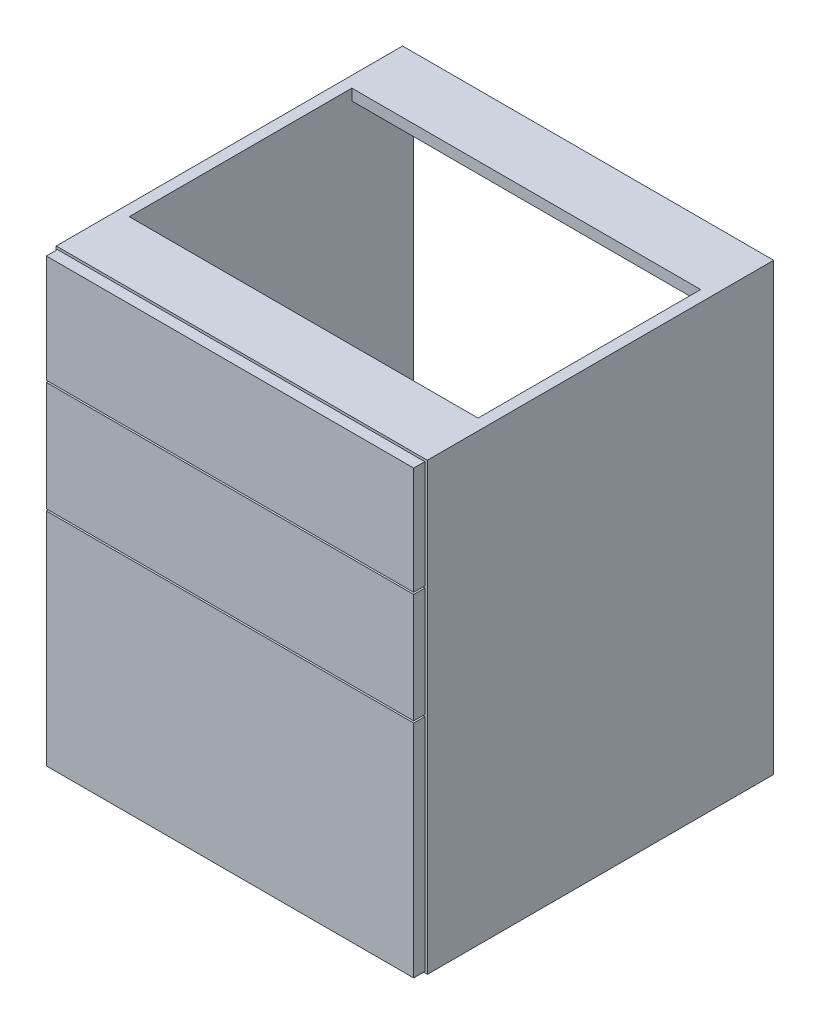
ISO-10303-21;
HEADER;
FILE_DESCRIPTION(('STEP AP214'),'2;1');
FILE_NAME('part.step','',(''),(''),'','','');
FILE_SCHEMA(('AUTOMOTIVE_DESIGN { 1 0 10303 214 1 1 1 1 }'));
ENDSEC;
DATA;
#1=APPLICATION_CONTEXT('core data for automotive mechanical design processes');
#2=APPLICATION_PROTOCOL_DEFINITION('international standard','automotive_design',2000,#1);
#3=PRODUCT_CONTEXT('',#1,'mechanical');
#4=PRODUCT('Part','Part','',(#3));
#5=PRODUCT_RELATED_PRODUCT_CATEGORY('part','',(#4));
#6=PRODUCT_DEFINITION_FORMATION('','',#4);
#7=PRODUCT_DEFINITION_CONTEXT('part definition',#1,'design');
#8=PRODUCT_DEFINITION('design','',#6,#7);
#9=PRODUCT_DEFINITION_SHAPE('','',#8);
#10=(LENGTH_UNIT() NAMED_UNIT(*) SI_UNIT(.MILLI.,.METRE.));
#11=(NAMED_UNIT(*) PLANE_ANGLE_UNIT() SI_UNIT($,.RADIAN.));
#12=(NAMED_UNIT(*) SI_UNIT($,.STERADIAN.) SOLID_ANGLE_UNIT());
#13=UNCERTAINTY_MEASURE_WITH_UNIT(LENGTH_MEASURE(1.E-05),#10,'distance_accuracy_value','');
#14=(GEOMETRIC_REPRESENTATION_CONTEXT(3) GLOBAL_UNCERTAINTY_ASSIGNED_CONTEXT((#13)) GLOBAL_UNIT_ASSIGNED_CONTEXT((#10,
#11,#12)) REPRESENTATION_CONTEXT('',''));
#15=CARTESIAN_POINT('',(0.,0.,0.));
#16=DIRECTION('',(0.,0.,1.));
#17=DIRECTION('',(1.,0.,0.));
#18=AXIS2_PLACEMENT_3D('',#15,#16,#17);
#19=CARTESIAN_POINT('',(0.,0.,1.));
#20=DIRECTION('',(0.,0.,1.));
#21=DIRECTION('',(1.,0.,0.));
#22=AXIS2_PLACEMENT_3D('',#19,#20,#21);
#23=PLANE('',#22);
#24=DIRECTION('',(0.,1.,0.));
#25=VECTOR('',#24,1.);
#26=CARTESIAN_POINT('',(597.,717.,1.));
#27=LINE('',#26,#25);
#28=CARTESIAN_POINT('',(597.,543.,1.));
#29=VERTEX_POINT('',#28);
#30=CARTESIAN_POINT('',(597.,717.,1.));
#31=VERTEX_POINT('',#30);
#32=EDGE_CURVE('E101',#29,#31,#27,.T.);
#33=ORIENTED_EDGE('',*,*,#32,.F.);
#34=DIRECTION('',(-1.,0.,0.));
#35=VECTOR('',#34,1.);
#36=CARTESIAN_POINT('',(3.00000000000002,543.,1.));
#37=LINE('',#36,#35);
#38=CARTESIAN_POINT('',(3.00000000000002,543.,1.));
#39=VERTEX_POINT('',#38);
#40=EDGE_CURVE('E95',#29,#39,#37,.T.);
#41=ORIENTED_EDGE('',*,*,#40,.T.);
#42=DIRECTION('',(0.,-1.,0.));
#43=VECTOR('',#42,1.);
#44=CARTESIAN_POINT('',(3.,717.,1.));
#45=LINE('',#44,#43);
#46=CARTESIAN_POINT('',(3.,717.,1.));
#47=VERTEX_POINT('',#46);
#48=EDGE_CURVE('E52',#47,#39,#45,.T.);
#49=ORIENTED_EDGE('',*,*,#48,.F.);
#50=DIRECTION('',(-1.,0.,0.));
#51=VECTOR('',#50,1.);
#52=CARTESIAN_POINT('',(3.,717.,1.));
#53=LINE('',#52,#51);
#54=EDGE_CURVE('E104',#31,#47,#53,.T.);
#55=ORIENTED_EDGE('',*,*,#54,.F.);
#56=EDGE_LOOP('',(#33,#41,#49,#55));
#57=FACE_BOUND('',#56,.T.);
#58=ADVANCED_FACE('F49',(#57),#23,.F.);
#59=CARTESIAN_POINT('',(0.,0.,19.));
#60=DIRECTION('',(0.,0.,1.));
#61=DIRECTION('',(1.,0.,0.));
#62=AXIS2_PLACEMENT_3D('',#59,#60,#61);
#63=PLANE('',#62);
#64=DIRECTION('',(-1.,0.,0.));
#65=VECTOR('',#64,1.);
#66=CARTESIAN_POINT('',(3.00000000000002,543.,19.));
#67=LINE('',#66,#65);
#68=CARTESIAN_POINT('',(597.,543.,19.));
#69=VERTEX_POINT('',#68);
#70=CARTESIAN_POINT('',(3.00000000000002,543.,19.));
#71=VERTEX_POINT('',#70);
#72=EDGE_CURVE('E58',#69,#71,#67,.T.);
#73=ORIENTED_EDGE('',*,*,#72,.F.);
#74=DIRECTION('',(0.,1.,0.));
#75=VECTOR('',#74,1.);
#76=CARTESIAN_POINT('',(597.,717.,19.));
#77=LINE('',#76,#75);
#78=CARTESIAN_POINT('',(597.,717.,19.));
#79=VERTEX_POINT('',#78);
#80=EDGE_CURVE('E91',#69,#79,#77,.T.);
#81=ORIENTED_EDGE('',*,*,#80,.T.);
#82=DIRECTION('',(-1.,0.,0.));
#83=VECTOR('',#82,1.);
#84=CARTESIAN_POINT('',(3.,717.,19.));
#85=LINE('',#84,#83);
#86=CARTESIAN_POINT('',(3.,717.,19.));
#87=VERTEX_POINT('',#86);
#88=EDGE_CURVE('E88',#79,#87,#85,.T.);
#89=ORIENTED_EDGE('',*,*,#88,.T.);
#90=DIRECTION('',(0.,-1.,0.));
#91=VECTOR('',#90,1.);
#92=CARTESIAN_POINT('',(3.,717.,19.));
#93=LINE('',#92,#91);
#94=EDGE_CURVE('E110',#87,#71,#93,.T.);
#95=ORIENTED_EDGE('',*,*,#94,.T.);
#96=EDGE_LOOP('',(#73,#81,#89,#95));
#97=FACE_BOUND('',#96,.T.);
#98=ADVANCED_FACE('F93',(#97),#63,.T.);
#99=CARTESIAN_POINT('',(597.,717.,19.));
#100=DIRECTION('',(-1.,0.,0.));
#101=DIRECTION('',(0.,0.,1.));
#102=AXIS2_PLACEMENT_3D('',#99,#100,#101);
#103=PLANE('',#102);
#104=ORIENTED_EDGE('',*,*,#80,.F.);
#105=DIRECTION('',(0.,0.,1.));
#106=VECTOR('',#105,1.);
#107=CARTESIAN_POINT('',(597.,543.,1.));
#108=LINE('',#107,#106);
#109=EDGE_CURVE('E12',#29,#69,#108,.T.);
#110=ORIENTED_EDGE('',*,*,#109,.F.);
#111=ORIENTED_EDGE('',*,*,#32,.T.);
#112=DIRECTION('',(0.,0.,-1.));
#113=VECTOR('',#112,1.);
#114=CARTESIAN_POINT('',(597.,717.,19.));
#115=LINE('',#114,#113);
#116=EDGE_CURVE('E98',#79,#31,#115,.T.);
#117=ORIENTED_EDGE('',*,*,#116,.F.);
#118=EDGE_LOOP('',(#104,#110,#111,#117));
#119=FACE_BOUND('',#118,.T.);
#120=ADVANCED_FACE('F99',(#119),#103,.F.);
#121=CARTESIAN_POINT('',(3.,717.,19.));
#122=DIRECTION('',(1.,0.,0.));
#123=DIRECTION('',(0.,1.,0.));
#124=AXIS2_PLACEMENT_3D('',#121,#122,#123);
#125=PLANE('',#124);
#126=ORIENTED_EDGE('',*,*,#48,.T.);
#127=DIRECTION('',(0.,0.,1.));
#128=VECTOR('',#127,1.);
#129=CARTESIAN_POINT('',(3.00000000000002,543.,1.));
#130=LINE('',#129,#128);
#131=EDGE_CURVE('E73',#39,#71,#130,.T.);
#132=ORIENTED_EDGE('',*,*,#131,.T.);
#133=ORIENTED_EDGE('',*,*,#94,.F.);
#134=DIRECTION('',(0.,0.,-1.));
#135=VECTOR('',#134,1.);
#136=CARTESIAN_POINT('',(3.,717.,19.));
#137=LINE('',#136,#135);
#138=EDGE_CURVE('E108',#87,#47,#137,.T.);
#139=ORIENTED_EDGE('',*,*,#138,.T.);
#140=EDGE_LOOP('',(#126,#132,#133,#139));
#141=FACE_BOUND('',#140,.T.);
#142=ADVANCED_FACE('F121',(#141),#125,.F.);
#143=CARTESIAN_POINT('',(3.,717.,19.));
#144=DIRECTION('',(0.,-1.,0.));
#145=DIRECTION('',(0.,0.,-1.));
#146=AXIS2_PLACEMENT_3D('',#143,#144,#145);
#147=PLANE('',#146);
#148=ORIENTED_EDGE('',*,*,#54,.T.);
#149=ORIENTED_EDGE('',*,*,#138,.F.);
#150=ORIENTED_EDGE('',*,*,#88,.F.);
#151=ORIENTED_EDGE('',*,*,#116,.T.);
#152=EDGE_LOOP('',(#148,#149,#150,#151));
#153=FACE_BOUND('',#152,.T.);
#154=ADVANCED_FACE('F106',(#153),#147,.F.);
#155=CARTESIAN_POINT('',(3.00000000000002,543.,1.));
#156=DIRECTION('',(0.,1.,0.));
#157=DIRECTION('',(0.,0.,1.));
#158=AXIS2_PLACEMENT_3D('',#155,#156,#157);
#159=PLANE('',#158);
#160=ORIENTED_EDGE('',*,*,#72,.T.);
#161=ORIENTED_EDGE('',*,*,#131,.F.);
#162=ORIENTED_EDGE('',*,*,#40,.F.);
#163=ORIENTED_EDGE('',*,*,#109,.T.);
#164=EDGE_LOOP('',(#160,#161,#162,#163));
#165=FACE_BOUND('',#164,.T.);
#166=ADVANCED_FACE('F123',(#165),#159,.F.);
#167=CLOSED_SHELL('',(#58,#98,#120,#142,#154,#166));
#168=MANIFOLD_SOLID_BREP('B2',#167);
#169=CARTESIAN_POINT('',(3.,717.,19.));
#170=DIRECTION('',(1.,0.,0.));
#171=DIRECTION('',(0.,1.,0.));
#172=AXIS2_PLACEMENT_3D('',#169,#170,#171);
#173=PLANE('',#172);
#174=DIRECTION('',(0.,-1.,0.));
#175=VECTOR('',#174,1.);
#176=CARTESIAN_POINT('',(3.,717.,19.));
#177=LINE('',#176,#175);
#178=CARTESIAN_POINT('',(3.00000000000004,360.,19.));
#179=VERTEX_POINT('',#178);
#180=CARTESIAN_POINT('',(3.00000000000009,3.,19.));
#181=VERTEX_POINT('',#180);
#182=EDGE_CURVE('E239',#179,#181,#177,.T.);
#183=ORIENTED_EDGE('',*,*,#182,.F.);
#184=DIRECTION('',(0.,0.,1.));
#185=VECTOR('',#184,1.);
#186=CARTESIAN_POINT('',(3.00000000000004,360.,1.));
#187=LINE('',#186,#185);
#188=CARTESIAN_POINT('',(3.00000000000004,360.,1.));
#189=VERTEX_POINT('',#188);
#190=EDGE_CURVE('E47',#189,#179,#187,.T.);
#191=ORIENTED_EDGE('',*,*,#190,.F.);
#192=DIRECTION('',(0.,-1.,0.));
#193=VECTOR('',#192,1.);
#194=CARTESIAN_POINT('',(3.,717.,1.));
#195=LINE('',#194,#193);
#196=CARTESIAN_POINT('',(3.00000000000009,3.,1.));
#197=VERTEX_POINT('',#196);
#198=EDGE_CURVE('E185',#189,#197,#195,.T.);
#199=ORIENTED_EDGE('',*,*,#198,.T.);
#200=DIRECTION('',(0.,0.,-1.));
#201=VECTOR('',#200,1.);
#202=CARTESIAN_POINT('',(3.00000000000009,3.,19.));
#203=LINE('',#202,#201);
#204=EDGE_CURVE('E243',#181,#197,#203,.T.);
#205=ORIENTED_EDGE('',*,*,#204,.F.);
#206=EDGE_LOOP('',(#183,#191,#199,#205));
#207=FACE_BOUND('',#206,.T.);
#208=ADVANCED_FACE('F182',(#207),#173,.F.);
#209=CARTESIAN_POINT('',(597.,717.,19.));
#210=DIRECTION('',(-1.,0.,0.));
#211=DIRECTION('',(0.,0.,1.));
#212=AXIS2_PLACEMENT_3D('',#209,#210,#211);
#213=PLANE('',#212);
#214=DIRECTION('',(0.,1.,0.));
#215=VECTOR('',#214,1.);
#216=CARTESIAN_POINT('',(597.,717.,1.));
#217=LINE('',#216,#215);
#218=CARTESIAN_POINT('',(597.,3.,1.));
#219=VERTEX_POINT('',#218);
#220=CARTESIAN_POINT('',(597.,360.,1.));
#221=VERTEX_POINT('',#220);
#222=EDGE_CURVE('E225',#219,#221,#217,.T.);
#223=ORIENTED_EDGE('',*,*,#222,.T.);
#224=DIRECTION('',(0.,0.,1.));
#225=VECTOR('',#224,1.);
#226=CARTESIAN_POINT('',(597.,360.,1.));
#227=LINE('',#226,#225);
#228=CARTESIAN_POINT('',(597.,360.,19.));
#229=VERTEX_POINT('',#228);
#230=EDGE_CURVE('E216',#221,#229,#227,.T.);
#231=ORIENTED_EDGE('',*,*,#230,.T.);
#232=DIRECTION('',(0.,1.,0.));
#233=VECTOR('',#232,1.);
#234=CARTESIAN_POINT('',(597.,717.,19.));
#235=LINE('',#234,#233);
#236=CARTESIAN_POINT('',(597.,3.,19.));
#237=VERTEX_POINT('',#236);
#238=EDGE_CURVE('E233',#237,#229,#235,.T.);
#239=ORIENTED_EDGE('',*,*,#238,.F.);
#240=DIRECTION('',(0.,0.,-1.));
#241=VECTOR('',#240,1.);
#242=CARTESIAN_POINT('',(597.,3.,19.));
#243=LINE('',#242,#241);
#244=EDGE_CURVE('E224',#237,#219,#243,.T.);
#245=ORIENTED_EDGE('',*,*,#244,.T.);
#246=EDGE_LOOP('',(#223,#231,#239,#245));
#247=FACE_BOUND('',#246,.T.);
#248=ADVANCED_FACE('F236',(#247),#213,.F.);
#249=CARTESIAN_POINT('',(0.,0.,19.));
#250=DIRECTION('',(0.,0.,1.));
#251=DIRECTION('',(1.,0.,0.));
#252=AXIS2_PLACEMENT_3D('',#249,#250,#251);
#253=PLANE('',#252);
#254=DIRECTION('',(1.,0.,0.));
#255=VECTOR('',#254,1.);
#256=CARTESIAN_POINT('',(597.,360.,19.));
#257=LINE('',#256,#255);
#258=EDGE_CURVE('E191',#179,#229,#257,.T.);
#259=ORIENTED_EDGE('',*,*,#258,.F.);
#260=ORIENTED_EDGE('',*,*,#182,.T.);
#261=DIRECTION('',(1.,0.,0.));
#262=VECTOR('',#261,1.);
#263=CARTESIAN_POINT('',(3.00000000000009,3.,19.));
#264=LINE('',#263,#262);
#265=EDGE_CURVE('E241',#181,#237,#264,.T.);
#266=ORIENTED_EDGE('',*,*,#265,.T.);
#267=ORIENTED_EDGE('',*,*,#238,.T.);
#268=EDGE_LOOP('',(#259,#260,#266,#267));
#269=FACE_BOUND('',#268,.T.);
#270=ADVANCED_FACE('F256',(#269),#253,.T.);
#271=CARTESIAN_POINT('',(0.,0.,1.));
#272=DIRECTION('',(0.,0.,1.));
#273=DIRECTION('',(1.,0.,0.));
#274=AXIS2_PLACEMENT_3D('',#271,#272,#273);
#275=PLANE('',#274);
#276=ORIENTED_EDGE('',*,*,#198,.F.);
#277=DIRECTION('',(1.,0.,0.));
#278=VECTOR('',#277,1.);
#279=CARTESIAN_POINT('',(597.,360.,1.));
#280=LINE('',#279,#278);
#281=EDGE_CURVE('E219',#189,#221,#280,.T.);
#282=ORIENTED_EDGE('',*,*,#281,.T.);
#283=ORIENTED_EDGE('',*,*,#222,.F.);
#284=DIRECTION('',(1.,0.,0.));
#285=VECTOR('',#284,1.);
#286=CARTESIAN_POINT('',(3.00000000000009,3.,1.));
#287=LINE('',#286,#285);
#288=EDGE_CURVE('E232',#197,#219,#287,.T.);
#289=ORIENTED_EDGE('',*,*,#288,.F.);
#290=EDGE_LOOP('',(#276,#282,#283,#289));
#291=FACE_BOUND('',#290,.T.);
#292=ADVANCED_FACE('F230',(#291),#275,.F.);
#293=CARTESIAN_POINT('',(3.00000000000009,3.,19.));
#294=DIRECTION('',(0.,1.,0.));
#295=DIRECTION('',(0.,0.,1.));
#296=AXIS2_PLACEMENT_3D('',#293,#294,#295);
#297=PLANE('',#296);
#298=ORIENTED_EDGE('',*,*,#288,.T.);
#299=ORIENTED_EDGE('',*,*,#244,.F.);
#300=ORIENTED_EDGE('',*,*,#265,.F.);
#301=ORIENTED_EDGE('',*,*,#204,.T.);
#302=EDGE_LOOP('',(#298,#299,#300,#301));
#303=FACE_BOUND('',#302,.T.);
#304=ADVANCED_FACE('F252',(#303),#297,.F.);
#305=CARTESIAN_POINT('',(597.,360.,1.));
#306=DIRECTION('',(0.,-1.,0.));
#307=DIRECTION('',(0.,0.,-1.));
#308=AXIS2_PLACEMENT_3D('',#305,#306,#307);
#309=PLANE('',#308);
#310=ORIENTED_EDGE('',*,*,#258,.T.);
#311=ORIENTED_EDGE('',*,*,#230,.F.);
#312=ORIENTED_EDGE('',*,*,#281,.F.);
#313=ORIENTED_EDGE('',*,*,#190,.T.);
#314=EDGE_LOOP('',(#310,#311,#312,#313));
#315=FACE_BOUND('',#314,.T.);
#316=ADVANCED_FACE('F218',(#315),#309,.F.);
#317=CLOSED_SHELL('',(#208,#248,#270,#292,#304,#316));
#318=MANIFOLD_SOLID_BREP('B6',#317);
#319=CARTESIAN_POINT('',(597.,363.,1.));
#320=DIRECTION('',(0.,1.,0.));
#321=DIRECTION('',(-1.,0.,0.));
#322=AXIS2_PLACEMENT_3D('',#319,#320,#321);
#323=PLANE('',#322);
#324=DIRECTION('',(-1.,0.,0.));
#325=VECTOR('',#324,1.);
#326=CARTESIAN_POINT('',(597.,363.,19.));
#327=LINE('',#326,#325);
#328=CARTESIAN_POINT('',(597.,363.,19.));
#329=VERTEX_POINT('',#328);
#330=CARTESIAN_POINT('',(3.,363.,19.));
#331=VERTEX_POINT('',#330);
#332=EDGE_CURVE('E363',#329,#331,#327,.T.);
#333=ORIENTED_EDGE('',*,*,#332,.T.);
#334=DIRECTION('',(0.,0.,1.));
#335=VECTOR('',#334,1.);
#336=CARTESIAN_POINT('',(3.,363.,1.));
#337=LINE('',#336,#335);
#338=CARTESIAN_POINT('',(3.00000000000004,363.,1.));
#339=VERTEX_POINT('',#338);
#340=EDGE_CURVE('E375',#339,#331,#337,.T.);
#341=ORIENTED_EDGE('',*,*,#340,.F.);
#342=DIRECTION('',(-1.,0.,0.));
#343=VECTOR('',#342,1.);
#344=CARTESIAN_POINT('',(597.,363.,1.));
#345=LINE('',#344,#343);
#346=CARTESIAN_POINT('',(597.,363.,1.));
#347=VERTEX_POINT('',#346);
#348=EDGE_CURVE('E378',#347,#339,#345,.T.);
#349=ORIENTED_EDGE('',*,*,#348,.F.);
#350=DIRECTION('',(0.,0.,1.));
#351=VECTOR('',#350,1.);
#352=CARTESIAN_POINT('',(597.,363.,1.));
#353=LINE('',#352,#351);
#354=EDGE_CURVE('E373',#347,#329,#353,.T.);
#355=ORIENTED_EDGE('',*,*,#354,.T.);
#356=EDGE_LOOP('',(#333,#341,#349,#355));
#357=FACE_BOUND('',#356,.T.);
#358=ADVANCED_FACE('F314',(#357),#323,.F.);
#359=CARTESIAN_POINT('',(597.,717.,19.));
#360=DIRECTION('',(-1.,0.,0.));
#361=DIRECTION('',(0.,0.,1.));
#362=AXIS2_PLACEMENT_3D('',#359,#360,#361);
#363=PLANE('',#362);
#364=DIRECTION('',(0.,1.,0.));
#365=VECTOR('',#364,1.);
#366=CARTESIAN_POINT('',(597.,717.,1.));
#367=LINE('',#366,#365);
#368=CARTESIAN_POINT('',(597.,540.,1.));
#369=VERTEX_POINT('',#368);
#370=EDGE_CURVE('E318',#347,#369,#367,.T.);
#371=ORIENTED_EDGE('',*,*,#370,.T.);
#372=DIRECTION('',(0.,0.,1.));
#373=VECTOR('',#372,1.);
#374=CARTESIAN_POINT('',(597.,540.,1.));
#375=LINE('',#374,#373);
#376=CARTESIAN_POINT('',(597.,540.,19.));
#377=VERTEX_POINT('',#376);
#378=EDGE_CURVE('E356',#369,#377,#375,.T.);
#379=ORIENTED_EDGE('',*,*,#378,.T.);
#380=DIRECTION('',(0.,1.,0.));
#381=VECTOR('',#380,1.);
#382=CARTESIAN_POINT('',(597.,717.,19.));
#383=LINE('',#382,#381);
#384=EDGE_CURVE('E180',#329,#377,#383,.T.);
#385=ORIENTED_EDGE('',*,*,#384,.F.);
#386=ORIENTED_EDGE('',*,*,#354,.F.);
#387=EDGE_LOOP('',(#371,#379,#385,#386));
#388=FACE_BOUND('',#387,.T.);
#389=ADVANCED_FACE('F372',(#388),#363,.F.);
#390=CARTESIAN_POINT('',(3.,717.,19.));
#391=DIRECTION('',(1.,0.,0.));
#392=DIRECTION('',(0.,1.,0.));
#393=AXIS2_PLACEMENT_3D('',#390,#391,#392);
#394=PLANE('',#393);
#395=DIRECTION('',(0.,-1.,0.));
#396=VECTOR('',#395,1.);
#397=CARTESIAN_POINT('',(3.,717.,19.));
#398=LINE('',#397,#396);
#399=CARTESIAN_POINT('',(3.,540.,19.));
#400=VERTEX_POINT('',#399);
#401=EDGE_CURVE('E323',#400,#331,#398,.T.);
#402=ORIENTED_EDGE('',*,*,#401,.F.);
#403=DIRECTION('',(0.,0.,1.));
#404=VECTOR('',#403,1.);
#405=CARTESIAN_POINT('',(3.,540.,1.));
#406=LINE('',#405,#404);
#407=CARTESIAN_POINT('',(3.00000000000002,540.,1.));
#408=VERTEX_POINT('',#407);
#409=EDGE_CURVE('E364',#408,#400,#406,.T.);
#410=ORIENTED_EDGE('',*,*,#409,.F.);
#411=DIRECTION('',(0.,-1.,0.));
#412=VECTOR('',#411,1.);
#413=CARTESIAN_POINT('',(3.,717.,1.));
#414=LINE('',#413,#412);
#415=EDGE_CURVE('E338',#408,#339,#414,.T.);
#416=ORIENTED_EDGE('',*,*,#415,.T.);
#417=ORIENTED_EDGE('',*,*,#340,.T.);
#418=EDGE_LOOP('',(#402,#410,#416,#417));
#419=FACE_BOUND('',#418,.T.);
#420=ADVANCED_FACE('F316',(#419),#394,.F.);
#421=CARTESIAN_POINT('',(0.,0.,19.));
#422=DIRECTION('',(0.,0.,1.));
#423=DIRECTION('',(1.,0.,0.));
#424=AXIS2_PLACEMENT_3D('',#421,#422,#423);
#425=PLANE('',#424);
#426=DIRECTION('',(1.,0.,0.));
#427=VECTOR('',#426,1.);
#428=CARTESIAN_POINT('',(3.,540.,19.));
#429=LINE('',#428,#427);
#430=EDGE_CURVE('E359',#400,#377,#429,.T.);
#431=ORIENTED_EDGE('',*,*,#430,.F.);
#432=ORIENTED_EDGE('',*,*,#401,.T.);
#433=ORIENTED_EDGE('',*,*,#332,.F.);
#434=ORIENTED_EDGE('',*,*,#384,.T.);
#435=EDGE_LOOP('',(#431,#432,#433,#434));
#436=FACE_BOUND('',#435,.T.);
#437=ADVANCED_FACE('F386',(#436),#425,.T.);
#438=CARTESIAN_POINT('',(0.,0.,1.));
#439=DIRECTION('',(0.,0.,1.));
#440=DIRECTION('',(1.,0.,0.));
#441=AXIS2_PLACEMENT_3D('',#438,#439,#440);
#442=PLANE('',#441);
#443=ORIENTED_EDGE('',*,*,#415,.F.);
#444=DIRECTION('',(1.,0.,0.));
#445=VECTOR('',#444,1.);
#446=CARTESIAN_POINT('',(3.,540.,1.));
#447=LINE('',#446,#445);
#448=EDGE_CURVE('E331',#408,#369,#447,.T.);
#449=ORIENTED_EDGE('',*,*,#448,.T.);
#450=ORIENTED_EDGE('',*,*,#370,.F.);
#451=ORIENTED_EDGE('',*,*,#348,.T.);
#452=EDGE_LOOP('',(#443,#449,#450,#451));
#453=FACE_BOUND('',#452,.T.);
#454=ADVANCED_FACE('F368',(#453),#442,.F.);
#455=CARTESIAN_POINT('',(3.,540.,1.));
#456=DIRECTION('',(0.,-1.,0.));
#457=DIRECTION('',(0.,0.,-1.));
#458=AXIS2_PLACEMENT_3D('',#455,#456,#457);
#459=PLANE('',#458);
#460=ORIENTED_EDGE('',*,*,#430,.T.);
#461=ORIENTED_EDGE('',*,*,#378,.F.);
#462=ORIENTED_EDGE('',*,*,#448,.F.);
#463=ORIENTED_EDGE('',*,*,#409,.T.);
#464=EDGE_LOOP('',(#460,#461,#462,#463));
#465=FACE_BOUND('',#464,.T.);
#466=ADVANCED_FACE('F357',(#465),#459,.F.);
#467=CLOSED_SHELL('',(#358,#389,#420,#437,#454,#466));
#468=MANIFOLD_SOLID_BREP('B41',#467);
#469=CARTESIAN_POINT('',(18.,702.,-560.));
#470=DIRECTION('',(0.,1.,0.));
#471=DIRECTION('',(0.,0.,1.));
#472=AXIS2_PLACEMENT_3D('',#469,#470,#471);
#473=PLANE('',#472);
#474=DIRECTION('',(0.,0.,1.));
#475=VECTOR('',#474,1.);
#476=CARTESIAN_POINT('',(18.,702.,-560.));
#477=LINE('',#476,#475);
#478=CARTESIAN_POINT('',(18.,702.,-100.));
#479=VERTEX_POINT('',#478);
#480=CARTESIAN_POINT('',(18.,702.,0.));
#481=VERTEX_POINT('',#480);
#482=EDGE_CURVE('E608',#479,#481,#477,.T.);
#483=ORIENTED_EDGE('',*,*,#482,.F.);
#484=DIRECTION('',(1.,0.,0.));
#485=VECTOR('',#484,1.);
#486=CARTESIAN_POINT('',(18.,702.,-100.));
#487=LINE('',#486,#485);
#488=CARTESIAN_POINT('',(582.,702.,-100.));
#489=VERTEX_POINT('',#488);
#490=EDGE_CURVE('E566',#479,#489,#487,.T.);
#491=ORIENTED_EDGE('',*,*,#490,.T.);
#492=DIRECTION('',(0.,0.,1.));
#493=VECTOR('',#492,1.);
#494=CARTESIAN_POINT('',(582.,702.,-560.));
#495=LINE('',#494,#493);
#496=CARTESIAN_POINT('',(582.,702.,0.));
#497=VERTEX_POINT('',#496);
#498=EDGE_CURVE('E612',#489,#497,#495,.T.);
#499=ORIENTED_EDGE('',*,*,#498,.T.);
#500=DIRECTION('',(-1.,0.,0.));
#501=VECTOR('',#500,1.);
#502=CARTESIAN_POINT('',(18.,702.,0.));
#503=LINE('',#502,#501);
#504=EDGE_CURVE('E576',#497,#481,#503,.T.);
#505=ORIENTED_EDGE('',*,*,#504,.T.);
#506=EDGE_LOOP('',(#483,#491,#499,#505));
#507=FACE_BOUND('',#506,.T.);
#508=ADVANCED_FACE('F437',(#507),#473,.F.);
#509=CARTESIAN_POINT('',(0.,0.,-560.));
#510=DIRECTION('',(-1.,0.,0.));
#511=DIRECTION('',(0.,0.,1.));
#512=AXIS2_PLACEMENT_3D('',#509,#510,#511);
#513=PLANE('',#512);
#514=DIRECTION('',(0.,-1.,0.));
#515=VECTOR('',#514,1.);
#516=CARTESIAN_POINT('',(0.,0.,0.));
#517=LINE('',#516,#515);
#518=CARTESIAN_POINT('',(0.,720.,0.));
#519=VERTEX_POINT('',#518);
#520=CARTESIAN_POINT('',(0.,0.,0.));
#521=VERTEX_POINT('',#520);
#522=EDGE_CURVE('E607',#519,#521,#517,.T.);
#523=ORIENTED_EDGE('',*,*,#522,.F.);
#524=DIRECTION('',(0.,0.,1.));
#525=VECTOR('',#524,1.);
#526=CARTESIAN_POINT('',(0.,720.,-560.));
#527=LINE('',#526,#525);
#528=CARTESIAN_POINT('',(0.,720.,-560.));
#529=VERTEX_POINT('',#528);
#530=EDGE_CURVE('E312',#529,#519,#527,.T.);
#531=ORIENTED_EDGE('',*,*,#530,.F.);
#532=DIRECTION('',(0.,-1.,0.));
#533=VECTOR('',#532,1.);
#534=CARTESIAN_POINT('',(0.,0.,-560.));
#535=LINE('',#534,#533);
#536=CARTESIAN_POINT('',(0.,0.,-560.));
#537=VERTEX_POINT('',#536);
#538=EDGE_CURVE('E618',#529,#537,#535,.T.);
#539=ORIENTED_EDGE('',*,*,#538,.T.);
#540=DIRECTION('',(0.,0.,1.));
#541=VECTOR('',#540,1.);
#542=CARTESIAN_POINT('',(0.,0.,-560.));
#543=LINE('',#542,#541);
#544=EDGE_CURVE('E441',#537,#521,#543,.T.);
#545=ORIENTED_EDGE('',*,*,#544,.T.);
#546=EDGE_LOOP('',(#523,#531,#539,#545));
#547=FACE_BOUND('',#546,.T.);
#548=ADVANCED_FACE('F439',(#547),#513,.T.);
#549=CARTESIAN_POINT('',(0.,720.,-560.));
#550=DIRECTION('',(0.,1.,0.));
#551=DIRECTION('',(0.,0.,1.));
#552=AXIS2_PLACEMENT_3D('',#549,#550,#551);
#553=PLANE('',#552);
#554=DIRECTION('',(1.,0.,0.));
#555=VECTOR('',#554,1.);
#556=CARTESIAN_POINT('',(18.,720.,-100.));
#557=LINE('',#556,#555);
#558=CARTESIAN_POINT('',(18.,720.,-100.));
#559=VERTEX_POINT('',#558);
#560=CARTESIAN_POINT('',(582.,720.,-100.));
#561=VERTEX_POINT('',#560);
#562=EDGE_CURVE('E545',#559,#561,#557,.T.);
#563=ORIENTED_EDGE('',*,*,#562,.F.);
#564=DIRECTION('',(0.,0.,1.));
#565=VECTOR('',#564,1.);
#566=CARTESIAN_POINT('',(18.,720.,-460.));
#567=LINE('',#566,#565);
#568=CARTESIAN_POINT('',(18.,720.,-460.));
#569=VERTEX_POINT('',#568);
#570=EDGE_CURVE('E550',#569,#559,#567,.T.);
#571=ORIENTED_EDGE('',*,*,#570,.F.);
#572=DIRECTION('',(-1.,0.,0.));
#573=VECTOR('',#572,1.);
#574=CARTESIAN_POINT('',(18.,720.,-460.));
#575=LINE('',#574,#573);
#576=CARTESIAN_POINT('',(582.,720.,-460.));
#577=VERTEX_POINT('',#576);
#578=EDGE_CURVE('E455',#577,#569,#575,.T.);
#579=ORIENTED_EDGE('',*,*,#578,.F.);
#580=DIRECTION('',(0.,0.,-1.));
#581=VECTOR('',#580,1.);
#582=CARTESIAN_POINT('',(582.,720.,-460.));
#583=LINE('',#582,#581);
#584=EDGE_CURVE('E538',#561,#577,#583,.T.);
#585=ORIENTED_EDGE('',*,*,#584,.F.);
#586=EDGE_LOOP('',(#563,#571,#579,#585));
#587=FACE_BOUND('',#586,.T.);
#588=DIRECTION('',(-1.,0.,0.));
#589=VECTOR('',#588,1.);
#590=CARTESIAN_POINT('',(0.,720.,0.));
#591=LINE('',#590,#589);
#592=CARTESIAN_POINT('',(600.,720.,0.));
#593=VERTEX_POINT('',#592);
#594=EDGE_CURVE('E623',#593,#519,#591,.T.);
#595=ORIENTED_EDGE('',*,*,#594,.F.);
#596=DIRECTION('',(0.,0.,1.));
#597=VECTOR('',#596,1.);
#598=CARTESIAN_POINT('',(600.,720.,-560.));
#599=LINE('',#598,#597);
#600=CARTESIAN_POINT('',(600.,720.,-560.));
#601=VERTEX_POINT('',#600);
#602=EDGE_CURVE('E447',#601,#593,#599,.T.);
#603=ORIENTED_EDGE('',*,*,#602,.F.);
#604=DIRECTION('',(-1.,0.,0.));
#605=VECTOR('',#604,1.);
#606=CARTESIAN_POINT('',(0.,720.,-560.));
#607=LINE('',#606,#605);
#608=EDGE_CURVE('E631',#601,#529,#607,.T.);
#609=ORIENTED_EDGE('',*,*,#608,.T.);
#610=ORIENTED_EDGE('',*,*,#530,.T.);
#611=EDGE_LOOP('',(#595,#603,#609,#610));
#612=FACE_BOUND('',#611,.T.);
#613=ADVANCED_FACE('F548',(#587,#612),#553,.T.);
#614=CARTESIAN_POINT('',(600.,0.,-560.));
#615=DIRECTION('',(1.,0.,0.));
#616=DIRECTION('',(0.,0.,-1.));
#617=AXIS2_PLACEMENT_3D('',#614,#615,#616);
#618=PLANE('',#617);
#619=DIRECTION('',(0.,1.,0.));
#620=VECTOR('',#619,1.);
#621=CARTESIAN_POINT('',(600.,0.,0.));
#622=LINE('',#621,#620);
#623=CARTESIAN_POINT('',(600.,0.,0.));
#624=VERTEX_POINT('',#623);
#625=EDGE_CURVE('E642',#624,#593,#622,.T.);
#626=ORIENTED_EDGE('',*,*,#625,.F.);
#627=DIRECTION('',(0.,0.,1.));
#628=VECTOR('',#627,1.);
#629=CARTESIAN_POINT('',(600.,0.,-560.));
#630=LINE('',#629,#628);
#631=CARTESIAN_POINT('',(600.,0.,-560.));
#632=VERTEX_POINT('',#631);
#633=EDGE_CURVE('E650',#632,#624,#630,.T.);
#634=ORIENTED_EDGE('',*,*,#633,.F.);
#635=DIRECTION('',(0.,1.,0.));
#636=VECTOR('',#635,1.);
#637=CARTESIAN_POINT('',(600.,0.,-560.));
#638=LINE('',#637,#636);
#639=EDGE_CURVE('E627',#632,#601,#638,.T.);
#640=ORIENTED_EDGE('',*,*,#639,.T.);
#641=ORIENTED_EDGE('',*,*,#602,.T.);
#642=EDGE_LOOP('',(#626,#634,#640,#641));
#643=FACE_BOUND('',#642,.T.);
#644=ADVANCED_FACE('F669',(#643),#618,.T.);
#645=CARTESIAN_POINT('',(0.,0.,-560.));
#646=DIRECTION('',(0.,-1.,0.));
#647=DIRECTION('',(0.,0.,-1.));
#648=AXIS2_PLACEMENT_3D('',#645,#646,#647);
#649=PLANE('',#648);
#650=DIRECTION('',(1.,0.,0.));
#651=VECTOR('',#650,1.);
#652=CARTESIAN_POINT('',(0.,0.,0.));
#653=LINE('',#652,#651);
#654=EDGE_CURVE('E638',#521,#624,#653,.T.);
#655=ORIENTED_EDGE('',*,*,#654,.F.);
#656=ORIENTED_EDGE('',*,*,#544,.F.);
#657=DIRECTION('',(1.,0.,0.));
#658=VECTOR('',#657,1.);
#659=CARTESIAN_POINT('',(0.,0.,-560.));
#660=LINE('',#659,#658);
#661=EDGE_CURVE('E622',#537,#632,#660,.T.);
#662=ORIENTED_EDGE('',*,*,#661,.T.);
#663=ORIENTED_EDGE('',*,*,#633,.T.);
#664=EDGE_LOOP('',(#655,#656,#662,#663));
#665=FACE_BOUND('',#664,.T.);
#666=ADVANCED_FACE('F660',(#665),#649,.T.);
#667=CARTESIAN_POINT('',(0.,0.,-560.));
#668=DIRECTION('',(0.,0.,-1.));
#669=DIRECTION('',(-1.,0.,0.));
#670=AXIS2_PLACEMENT_3D('',#667,#668,#669);
#671=PLANE('',#670);
#672=DIRECTION('',(0.,-1.,0.));
#673=VECTOR('',#672,1.);
#674=CARTESIAN_POINT('',(18.,702.,-560.));
#675=LINE('',#674,#673);
#676=CARTESIAN_POINT('',(18.,702.,-560.));
#677=VERTEX_POINT('',#676);
#678=CARTESIAN_POINT('',(18.0000000000001,18.,-560.));
#679=VERTEX_POINT('',#678);
#680=EDGE_CURVE('E571',#677,#679,#675,.T.);
#681=ORIENTED_EDGE('',*,*,#680,.T.);
#682=DIRECTION('',(1.,0.,0.));
#683=VECTOR('',#682,1.);
#684=CARTESIAN_POINT('',(18.0000000000001,18.,-560.));
#685=LINE('',#684,#683);
#686=CARTESIAN_POINT('',(582.,18.,-560.));
#687=VERTEX_POINT('',#686);
#688=EDGE_CURVE('E575',#679,#687,#685,.T.);
#689=ORIENTED_EDGE('',*,*,#688,.T.);
#690=DIRECTION('',(0.,1.,0.));
#691=VECTOR('',#690,1.);
#692=CARTESIAN_POINT('',(582.,702.,-560.));
#693=LINE('',#692,#691);
#694=CARTESIAN_POINT('',(582.,702.,-560.));
#695=VERTEX_POINT('',#694);
#696=EDGE_CURVE('E580',#687,#695,#693,.T.);
#697=ORIENTED_EDGE('',*,*,#696,.T.);
#698=DIRECTION('',(-1.,0.,0.));
#699=VECTOR('',#698,1.);
#700=CARTESIAN_POINT('',(18.,702.,-560.));
#701=LINE('',#700,#699);
#702=EDGE_CURVE('E584',#695,#677,#701,.T.);
#703=ORIENTED_EDGE('',*,*,#702,.T.);
#704=EDGE_LOOP('',(#681,#689,#697,#703));
#705=FACE_BOUND('',#704,.T.);
#706=ORIENTED_EDGE('',*,*,#538,.F.);
#707=ORIENTED_EDGE('',*,*,#608,.F.);
#708=ORIENTED_EDGE('',*,*,#639,.F.);
#709=ORIENTED_EDGE('',*,*,#661,.F.);
#710=EDGE_LOOP('',(#706,#707,#708,#709));
#711=FACE_BOUND('',#710,.T.);
#712=ADVANCED_FACE('F666',(#705,#711),#671,.T.);
#713=CARTESIAN_POINT('',(0.,0.,0.));
#714=DIRECTION('',(0.,0.,-1.));
#715=DIRECTION('',(-1.,0.,0.));
#716=AXIS2_PLACEMENT_3D('',#713,#714,#715);
#717=PLANE('',#716);
#718=DIRECTION('',(1.,0.,0.));
#719=VECTOR('',#718,1.);
#720=CARTESIAN_POINT('',(18.0000000000001,18.,0.));
#721=LINE('',#720,#719);
#722=CARTESIAN_POINT('',(18.0000000000001,18.,0.));
#723=VERTEX_POINT('',#722);
#724=CARTESIAN_POINT('',(582.,18.,0.));
#725=VERTEX_POINT('',#724);
#726=EDGE_CURVE('E592',#723,#725,#721,.T.);
#727=ORIENTED_EDGE('',*,*,#726,.F.);
#728=DIRECTION('',(0.,-1.,0.));
#729=VECTOR('',#728,1.);
#730=CARTESIAN_POINT('',(18.,702.,0.));
#731=LINE('',#730,#729);
#732=EDGE_CURVE('E570',#481,#723,#731,.T.);
#733=ORIENTED_EDGE('',*,*,#732,.F.);
#734=ORIENTED_EDGE('',*,*,#504,.F.);
#735=DIRECTION('',(0.,1.,0.));
#736=VECTOR('',#735,1.);
#737=CARTESIAN_POINT('',(582.,702.,0.));
#738=LINE('',#737,#736);
#739=EDGE_CURVE('E596',#725,#497,#738,.T.);
#740=ORIENTED_EDGE('',*,*,#739,.F.);
#741=EDGE_LOOP('',(#727,#733,#734,#740));
#742=FACE_BOUND('',#741,.T.);
#743=ORIENTED_EDGE('',*,*,#522,.T.);
#744=ORIENTED_EDGE('',*,*,#654,.T.);
#745=ORIENTED_EDGE('',*,*,#625,.T.);
#746=ORIENTED_EDGE('',*,*,#594,.T.);
#747=EDGE_LOOP('',(#743,#744,#745,#746));
#748=FACE_BOUND('',#747,.T.);
#749=ADVANCED_FACE('F662',(#742,#748),#717,.F.);
#750=CARTESIAN_POINT('',(18.,702.,-560.));
#751=DIRECTION('',(-1.,0.,0.));
#752=DIRECTION('',(0.,-1.,0.));
#753=AXIS2_PLACEMENT_3D('',#750,#751,#752);
#754=PLANE('',#753);
#755=CARTESIAN_POINT('',(18.,702.,-460.));
#756=VERTEX_POINT('',#755);
#757=EDGE_CURVE('E603',#677,#756,#477,.T.);
#758=ORIENTED_EDGE('',*,*,#757,.T.);
#759=DIRECTION('',(0.,1.,0.));
#760=VECTOR('',#759,1.);
#761=CARTESIAN_POINT('',(18.,-651.100889253631,-460.));
#762=LINE('',#761,#760);
#763=EDGE_CURVE('E534',#756,#569,#762,.T.);
#764=ORIENTED_EDGE('',*,*,#763,.T.);
#765=ORIENTED_EDGE('',*,*,#570,.T.);
#766=DIRECTION('',(0.,1.,0.));
#767=VECTOR('',#766,1.);
#768=CARTESIAN_POINT('',(18.,-651.100889253631,-100.));
#769=LINE('',#768,#767);
#770=EDGE_CURVE('E463',#479,#559,#769,.T.);
#771=ORIENTED_EDGE('',*,*,#770,.F.);
#772=ORIENTED_EDGE('',*,*,#482,.T.);
#773=ORIENTED_EDGE('',*,*,#732,.T.);
#774=DIRECTION('',(0.,0.,1.));
#775=VECTOR('',#774,1.);
#776=CARTESIAN_POINT('',(18.0000000000001,18.,-560.));
#777=LINE('',#776,#775);
#778=EDGE_CURVE('E588',#679,#723,#777,.T.);
#779=ORIENTED_EDGE('',*,*,#778,.F.);
#780=ORIENTED_EDGE('',*,*,#680,.F.);
#781=EDGE_LOOP('',(#758,#764,#765,#771,#772,#773,#779,#780));
#782=FACE_BOUND('',#781,.T.);
#783=ADVANCED_FACE('F688',(#782),#754,.F.);
#784=CARTESIAN_POINT('',(582.,702.,-460.));
#785=VERTEX_POINT('',#784);
#786=EDGE_CURVE('E609',#695,#785,#495,.T.);
#787=ORIENTED_EDGE('',*,*,#786,.T.);
#788=DIRECTION('',(-1.,0.,0.));
#789=VECTOR('',#788,1.);
#790=CARTESIAN_POINT('',(18.,702.,-460.));
#791=LINE('',#790,#789);
#792=EDGE_CURVE('E530',#785,#756,#791,.T.);
#793=ORIENTED_EDGE('',*,*,#792,.T.);
#794=ORIENTED_EDGE('',*,*,#757,.F.);
#795=ORIENTED_EDGE('',*,*,#702,.F.);
#796=EDGE_LOOP('',(#787,#793,#794,#795));
#797=FACE_BOUND('',#796,.T.);
#798=ADVANCED_FACE('F680',(#797),#473,.F.);
#799=CARTESIAN_POINT('',(582.,702.,-560.));
#800=DIRECTION('',(1.,0.,0.));
#801=DIRECTION('',(0.,1.,0.));
#802=AXIS2_PLACEMENT_3D('',#799,#800,#801);
#803=PLANE('',#802);
#804=DIRECTION('',(0.,0.,1.));
#805=VECTOR('',#804,1.);
#806=CARTESIAN_POINT('',(582.,18.,-560.));
#807=LINE('',#806,#805);
#808=EDGE_CURVE('E613',#687,#725,#807,.T.);
#809=ORIENTED_EDGE('',*,*,#808,.T.);
#810=ORIENTED_EDGE('',*,*,#739,.T.);
#811=ORIENTED_EDGE('',*,*,#498,.F.);
#812=DIRECTION('',(0.,1.,0.));
#813=VECTOR('',#812,1.);
#814=CARTESIAN_POINT('',(582.,-651.100889253631,-100.));
#815=LINE('',#814,#813);
#816=EDGE_CURVE('E535',#489,#561,#815,.T.);
#817=ORIENTED_EDGE('',*,*,#816,.T.);
#818=ORIENTED_EDGE('',*,*,#584,.T.);
#819=DIRECTION('',(0.,1.,0.));
#820=VECTOR('',#819,1.);
#821=CARTESIAN_POINT('',(582.,-651.100889253631,-460.));
#822=LINE('',#821,#820);
#823=EDGE_CURVE('E526',#785,#577,#822,.T.);
#824=ORIENTED_EDGE('',*,*,#823,.F.);
#825=ORIENTED_EDGE('',*,*,#786,.F.);
#826=ORIENTED_EDGE('',*,*,#696,.F.);
#827=EDGE_LOOP('',(#809,#810,#811,#817,#818,#824,#825,#826));
#828=FACE_BOUND('',#827,.T.);
#829=ADVANCED_FACE('F539',(#828),#803,.F.);
#830=CARTESIAN_POINT('',(18.0000000000001,18.,-560.));
#831=DIRECTION('',(0.,-1.,0.));
#832=DIRECTION('',(0.,0.,-1.));
#833=AXIS2_PLACEMENT_3D('',#830,#831,#832);
#834=PLANE('',#833);
#835=ORIENTED_EDGE('',*,*,#778,.T.);
#836=ORIENTED_EDGE('',*,*,#726,.T.);
#837=ORIENTED_EDGE('',*,*,#808,.F.);
#838=ORIENTED_EDGE('',*,*,#688,.F.);
#839=EDGE_LOOP('',(#835,#836,#837,#838));
#840=FACE_BOUND('',#839,.T.);
#841=ADVANCED_FACE('F694',(#840),#834,.F.);
#842=CARTESIAN_POINT('',(18.,-651.100889253631,-100.));
#843=DIRECTION('',(0.,0.,1.));
#844=DIRECTION('',(1.,0.,0.));
#845=AXIS2_PLACEMENT_3D('',#842,#843,#844);
#846=PLANE('',#845);
#847=ORIENTED_EDGE('',*,*,#770,.T.);
#848=ORIENTED_EDGE('',*,*,#562,.T.);
#849=ORIENTED_EDGE('',*,*,#816,.F.);
#850=ORIENTED_EDGE('',*,*,#490,.F.);
#851=EDGE_LOOP('',(#847,#848,#849,#850));
#852=FACE_BOUND('',#851,.T.);
#853=ADVANCED_FACE('F710',(#852),#846,.F.);
#854=CARTESIAN_POINT('',(18.,-651.100889253631,-460.));
#855=DIRECTION('',(0.,0.,-1.));
#856=DIRECTION('',(-1.,0.,0.));
#857=AXIS2_PLACEMENT_3D('',#854,#855,#856);
#858=PLANE('',#857);
#859=ORIENTED_EDGE('',*,*,#823,.T.);
#860=ORIENTED_EDGE('',*,*,#578,.T.);
#861=ORIENTED_EDGE('',*,*,#763,.F.);
#862=ORIENTED_EDGE('',*,*,#792,.F.);
#863=EDGE_LOOP('',(#859,#860,#861,#862));
#864=FACE_BOUND('',#863,.T.);
#865=ADVANCED_FACE('F528',(#864),#858,.F.);
#866=CLOSED_SHELL('',(#508,#548,#613,#644,#666,#712,#749,#783,#798,#829,#841,#853,#865));
#867=MANIFOLD_SOLID_BREP('B174',#866);
#868=ADVANCED_BREP_SHAPE_REPRESENTATION('',(#18,#168,#318,#468,#867),#14);
#869=SHAPE_DEFINITION_REPRESENTATION(#9,#868);
ENDSEC;
END-ISO-10303-21;
